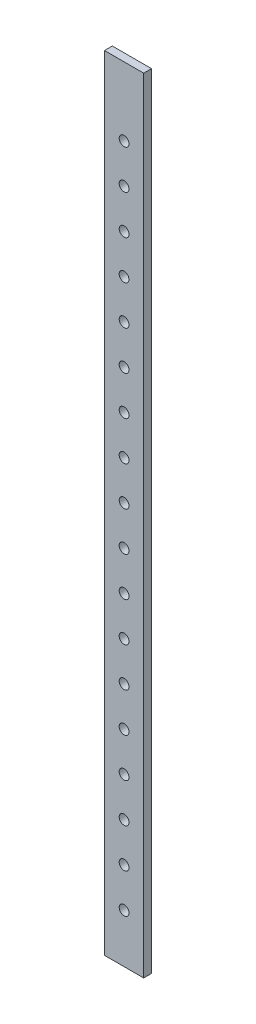
ISO-10303-21;
HEADER;
FILE_DESCRIPTION(('STEP AP214'),'2;1');
FILE_NAME('part.step','',(''),(''),'','','');
FILE_SCHEMA(('AUTOMOTIVE_DESIGN { 1 0 10303 214 1 1 1 1 }'));
ENDSEC;
DATA;
#1=APPLICATION_CONTEXT('core data for automotive mechanical design processes');
#2=APPLICATION_PROTOCOL_DEFINITION('international standard','automotive_design',2000,#1);
#3=PRODUCT_CONTEXT('',#1,'mechanical');
#4=PRODUCT('Part','Part','',(#3));
#5=PRODUCT_RELATED_PRODUCT_CATEGORY('part','',(#4));
#6=PRODUCT_DEFINITION_FORMATION('','',#4);
#7=PRODUCT_DEFINITION_CONTEXT('part definition',#1,'design');
#8=PRODUCT_DEFINITION('design','',#6,#7);
#9=PRODUCT_DEFINITION_SHAPE('','',#8);
#10=(LENGTH_UNIT() NAMED_UNIT(*) SI_UNIT(.MILLI.,.METRE.));
#11=(NAMED_UNIT(*) PLANE_ANGLE_UNIT() SI_UNIT($,.RADIAN.));
#12=(NAMED_UNIT(*) SI_UNIT($,.STERADIAN.) SOLID_ANGLE_UNIT());
#13=UNCERTAINTY_MEASURE_WITH_UNIT(LENGTH_MEASURE(1.E-05),#10,'distance_accuracy_value','');
#14=(GEOMETRIC_REPRESENTATION_CONTEXT(3) GLOBAL_UNCERTAINTY_ASSIGNED_CONTEXT((#13)) GLOBAL_UNIT_ASSIGNED_CONTEXT((#10,
#11,#12)) REPRESENTATION_CONTEXT('',''));
#15=CARTESIAN_POINT('',(0.,0.,0.));
#16=DIRECTION('',(0.,0.,1.));
#17=DIRECTION('',(1.,0.,0.));
#18=AXIS2_PLACEMENT_3D('',#15,#16,#17);
#19=CARTESIAN_POINT('',(10.,400.,-2.));
#20=DIRECTION('',(-1.,0.,0.));
#21=DIRECTION('',(0.,0.,1.));
#22=AXIS2_PLACEMENT_3D('',#19,#20,#21);
#23=PLANE('',#22);
#24=DIRECTION('',(0.,0.,-1.));
#25=VECTOR('',#24,1.);
#26=CARTESIAN_POINT('',(10.,0.,-2.));
#27=LINE('',#26,#25);
#28=CARTESIAN_POINT('',(10.,0.,2.));
#29=VERTEX_POINT('',#28);
#30=CARTESIAN_POINT('',(10.,0.,-2.));
#31=VERTEX_POINT('',#30);
#32=EDGE_CURVE('E98',#29,#31,#27,.T.);
#33=ORIENTED_EDGE('',*,*,#32,.T.);
#34=DIRECTION('',(0.,-1.,0.));
#35=VECTOR('',#34,1.);
#36=CARTESIAN_POINT('',(10.,400.,-2.));
#37=LINE('',#36,#35);
#38=CARTESIAN_POINT('',(10.,400.,-2.));
#39=VERTEX_POINT('',#38);
#40=EDGE_CURVE('E11',#39,#31,#37,.T.);
#41=ORIENTED_EDGE('',*,*,#40,.F.);
#42=DIRECTION('',(0.,0.,-1.));
#43=VECTOR('',#42,1.);
#44=CARTESIAN_POINT('',(10.,400.,-2.));
#45=LINE('',#44,#43);
#46=CARTESIAN_POINT('',(10.,400.,2.));
#47=VERTEX_POINT('',#46);
#48=EDGE_CURVE('E86',#47,#39,#45,.T.);
#49=ORIENTED_EDGE('',*,*,#48,.F.);
#50=DIRECTION('',(0.,-1.,0.));
#51=VECTOR('',#50,1.);
#52=CARTESIAN_POINT('',(10.,400.,2.));
#53=LINE('',#52,#51);
#54=EDGE_CURVE('E94',#47,#29,#53,.T.);
#55=ORIENTED_EDGE('',*,*,#54,.T.);
#56=EDGE_LOOP('',(#33,#41,#49,#55));
#57=FACE_BOUND('',#56,.T.);
#58=ADVANCED_FACE('F35',(#57),#23,.F.);
#59=CARTESIAN_POINT('',(-10.,400.,-2.));
#60=DIRECTION('',(0.,0.,1.));
#61=DIRECTION('',(1.,0.,0.));
#62=AXIS2_PLACEMENT_3D('',#59,#60,#61);
#63=PLANE('',#62);
#64=CARTESIAN_POINT('',(0.,25.,-2.));
#65=DIRECTION('',(0.,0.,1.));
#66=DIRECTION('',(1.,0.,0.));
#67=AXIS2_PLACEMENT_3D('',#64,#65,#66);
#68=CIRCLE('',#67,2.5);
#69=CARTESIAN_POINT('',(2.5,25.,-2.));
#70=VERTEX_POINT('',#69);
#71=EDGE_CURVE('E101',#70,#70,#68,.T.);
#72=ORIENTED_EDGE('',*,*,#71,.T.);
#73=EDGE_LOOP('',(#72));
#74=FACE_BOUND('',#73,.T.);
#75=CARTESIAN_POINT('',(0.,45.,-2.));
#76=DIRECTION('',(0.,0.,1.));
#77=DIRECTION('',(1.,0.,0.));
#78=AXIS2_PLACEMENT_3D('',#75,#76,#77);
#79=CIRCLE('',#78,2.5);
#80=CARTESIAN_POINT('',(2.49999999999993,45.,-2.));
#81=VERTEX_POINT('',#80);
#82=EDGE_CURVE('E211',#81,#81,#79,.T.);
#83=ORIENTED_EDGE('',*,*,#82,.T.);
#84=EDGE_LOOP('',(#83));
#85=FACE_BOUND('',#84,.T.);
#86=CARTESIAN_POINT('',(-1.39659253553725E-13,65.,-2.));
#87=DIRECTION('',(0.,0.,1.));
#88=DIRECTION('',(1.,0.,0.));
#89=AXIS2_PLACEMENT_3D('',#86,#87,#88);
#90=CIRCLE('',#89,2.5);
#91=CARTESIAN_POINT('',(2.49999999999986,65.,-2.));
#92=VERTEX_POINT('',#91);
#93=EDGE_CURVE('E205',#92,#92,#90,.T.);
#94=ORIENTED_EDGE('',*,*,#93,.T.);
#95=EDGE_LOOP('',(#94));
#96=FACE_BOUND('',#95,.T.);
#97=CARTESIAN_POINT('',(-2.09488880330588E-13,85.,-2.));
#98=DIRECTION('',(0.,0.,1.));
#99=DIRECTION('',(1.,0.,0.));
#100=AXIS2_PLACEMENT_3D('',#97,#98,#99);
#101=CIRCLE('',#100,2.5);
#102=CARTESIAN_POINT('',(2.49999999999979,85.,-2.));
#103=VERTEX_POINT('',#102);
#104=EDGE_CURVE('E199',#103,#103,#101,.T.);
#105=ORIENTED_EDGE('',*,*,#104,.T.);
#106=EDGE_LOOP('',(#105));
#107=FACE_BOUND('',#106,.T.);
#108=CARTESIAN_POINT('',(-2.79318507107451E-13,105.,-2.));
#109=DIRECTION('',(0.,0.,1.));
#110=DIRECTION('',(1.,0.,0.));
#111=AXIS2_PLACEMENT_3D('',#108,#109,#110);
#112=CIRCLE('',#111,2.5);
#113=CARTESIAN_POINT('',(2.49999999999972,105.,-2.));
#114=VERTEX_POINT('',#113);
#115=EDGE_CURVE('E193',#114,#114,#112,.T.);
#116=ORIENTED_EDGE('',*,*,#115,.T.);
#117=EDGE_LOOP('',(#116));
#118=FACE_BOUND('',#117,.T.);
#119=CARTESIAN_POINT('',(-3.49148133884313E-13,125.,-2.));
#120=DIRECTION('',(0.,0.,1.));
#121=DIRECTION('',(1.,0.,0.));
#122=AXIS2_PLACEMENT_3D('',#119,#120,#121);
#123=CIRCLE('',#122,2.5);
#124=CARTESIAN_POINT('',(2.49999999999965,125.,-2.));
#125=VERTEX_POINT('',#124);
#126=EDGE_CURVE('E187',#125,#125,#123,.T.);
#127=ORIENTED_EDGE('',*,*,#126,.T.);
#128=EDGE_LOOP('',(#127));
#129=FACE_BOUND('',#128,.T.);
#130=CARTESIAN_POINT('',(-4.18977760661176E-13,145.,-2.));
#131=DIRECTION('',(0.,0.,1.));
#132=DIRECTION('',(1.,0.,0.));
#133=AXIS2_PLACEMENT_3D('',#130,#131,#132);
#134=CIRCLE('',#133,2.5);
#135=CARTESIAN_POINT('',(2.49999999999958,145.,-2.));
#136=VERTEX_POINT('',#135);
#137=EDGE_CURVE('E181',#136,#136,#134,.T.);
#138=ORIENTED_EDGE('',*,*,#137,.T.);
#139=EDGE_LOOP('',(#138));
#140=FACE_BOUND('',#139,.T.);
#141=CARTESIAN_POINT('',(-4.88807387438039E-13,165.,-2.));
#142=DIRECTION('',(0.,0.,1.));
#143=DIRECTION('',(1.,0.,0.));
#144=AXIS2_PLACEMENT_3D('',#141,#142,#143);
#145=CIRCLE('',#144,2.5);
#146=CARTESIAN_POINT('',(2.49999999999951,165.,-2.));
#147=VERTEX_POINT('',#146);
#148=EDGE_CURVE('E175',#147,#147,#145,.T.);
#149=ORIENTED_EDGE('',*,*,#148,.T.);
#150=EDGE_LOOP('',(#149));
#151=FACE_BOUND('',#150,.T.);
#152=CARTESIAN_POINT('',(-5.58637014214901E-13,185.,-2.));
#153=DIRECTION('',(0.,0.,1.));
#154=DIRECTION('',(1.,0.,0.));
#155=AXIS2_PLACEMENT_3D('',#152,#153,#154);
#156=CIRCLE('',#155,2.5);
#157=CARTESIAN_POINT('',(2.49999999999944,185.,-2.));
#158=VERTEX_POINT('',#157);
#159=EDGE_CURVE('E169',#158,#158,#156,.T.);
#160=ORIENTED_EDGE('',*,*,#159,.T.);
#161=EDGE_LOOP('',(#160));
#162=FACE_BOUND('',#161,.T.);
#163=CARTESIAN_POINT('',(-6.28466640991764E-13,205.,-2.));
#164=DIRECTION('',(0.,0.,1.));
#165=DIRECTION('',(1.,0.,0.));
#166=AXIS2_PLACEMENT_3D('',#163,#164,#165);
#167=CIRCLE('',#166,2.5);
#168=CARTESIAN_POINT('',(2.49999999999937,205.,-2.));
#169=VERTEX_POINT('',#168);
#170=EDGE_CURVE('E163',#169,#169,#167,.T.);
#171=ORIENTED_EDGE('',*,*,#170,.T.);
#172=EDGE_LOOP('',(#171));
#173=FACE_BOUND('',#172,.T.);
#174=CARTESIAN_POINT('',(-6.98296267768627E-13,225.,-2.));
#175=DIRECTION('',(0.,0.,1.));
#176=DIRECTION('',(1.,0.,0.));
#177=AXIS2_PLACEMENT_3D('',#174,#175,#176);
#178=CIRCLE('',#177,2.5);
#179=CARTESIAN_POINT('',(2.4999999999993,225.,-2.));
#180=VERTEX_POINT('',#179);
#181=EDGE_CURVE('E157',#180,#180,#178,.T.);
#182=ORIENTED_EDGE('',*,*,#181,.T.);
#183=EDGE_LOOP('',(#182));
#184=FACE_BOUND('',#183,.T.);
#185=CARTESIAN_POINT('',(-7.68125894545489E-13,245.,-2.));
#186=DIRECTION('',(0.,0.,1.));
#187=DIRECTION('',(1.,0.,0.));
#188=AXIS2_PLACEMENT_3D('',#185,#186,#187);
#189=CIRCLE('',#188,2.5);
#190=CARTESIAN_POINT('',(2.49999999999923,245.,-2.));
#191=VERTEX_POINT('',#190);
#192=EDGE_CURVE('E151',#191,#191,#189,.T.);
#193=ORIENTED_EDGE('',*,*,#192,.T.);
#194=EDGE_LOOP('',(#193));
#195=FACE_BOUND('',#194,.T.);
#196=CARTESIAN_POINT('',(-8.37955521322352E-13,265.,-2.));
#197=DIRECTION('',(0.,0.,1.));
#198=DIRECTION('',(1.,0.,0.));
#199=AXIS2_PLACEMENT_3D('',#196,#197,#198);
#200=CIRCLE('',#199,2.5);
#201=CARTESIAN_POINT('',(2.49999999999916,265.,-2.));
#202=VERTEX_POINT('',#201);
#203=EDGE_CURVE('E145',#202,#202,#200,.T.);
#204=ORIENTED_EDGE('',*,*,#203,.T.);
#205=EDGE_LOOP('',(#204));
#206=FACE_BOUND('',#205,.T.);
#207=CARTESIAN_POINT('',(-9.07785148099215E-13,285.,-2.));
#208=DIRECTION('',(0.,0.,1.));
#209=DIRECTION('',(1.,0.,0.));
#210=AXIS2_PLACEMENT_3D('',#207,#208,#209);
#211=CIRCLE('',#210,2.5);
#212=CARTESIAN_POINT('',(2.49999999999909,285.,-2.));
#213=VERTEX_POINT('',#212);
#214=EDGE_CURVE('E139',#213,#213,#211,.T.);
#215=ORIENTED_EDGE('',*,*,#214,.T.);
#216=EDGE_LOOP('',(#215));
#217=FACE_BOUND('',#216,.T.);
#218=CARTESIAN_POINT('',(-9.77614774876077E-13,305.,-2.));
#219=DIRECTION('',(0.,0.,1.));
#220=DIRECTION('',(1.,0.,0.));
#221=AXIS2_PLACEMENT_3D('',#218,#219,#220);
#222=CIRCLE('',#221,2.5);
#223=CARTESIAN_POINT('',(2.49999999999902,305.,-2.));
#224=VERTEX_POINT('',#223);
#225=EDGE_CURVE('E133',#224,#224,#222,.T.);
#226=ORIENTED_EDGE('',*,*,#225,.T.);
#227=EDGE_LOOP('',(#226));
#228=FACE_BOUND('',#227,.T.);
#229=CARTESIAN_POINT('',(-1.04744440165294E-12,325.,-2.));
#230=DIRECTION('',(0.,0.,1.));
#231=DIRECTION('',(1.,0.,0.));
#232=AXIS2_PLACEMENT_3D('',#229,#230,#231);
#233=CIRCLE('',#232,2.5);
#234=CARTESIAN_POINT('',(2.49999999999895,325.,-2.));
#235=VERTEX_POINT('',#234);
#236=EDGE_CURVE('E127',#235,#235,#233,.T.);
#237=ORIENTED_EDGE('',*,*,#236,.T.);
#238=EDGE_LOOP('',(#237));
#239=FACE_BOUND('',#238,.T.);
#240=CARTESIAN_POINT('',(-1.1172740284298E-12,345.,-2.));
#241=DIRECTION('',(0.,0.,1.));
#242=DIRECTION('',(1.,0.,0.));
#243=AXIS2_PLACEMENT_3D('',#240,#241,#242);
#244=CIRCLE('',#243,2.5);
#245=CARTESIAN_POINT('',(2.49999999999888,345.,-2.));
#246=VERTEX_POINT('',#245);
#247=EDGE_CURVE('E121',#246,#246,#244,.T.);
#248=ORIENTED_EDGE('',*,*,#247,.T.);
#249=EDGE_LOOP('',(#248));
#250=FACE_BOUND('',#249,.T.);
#251=CARTESIAN_POINT('',(-1.18710365520667E-12,365.,-2.));
#252=DIRECTION('',(0.,0.,1.));
#253=DIRECTION('',(1.,0.,0.));
#254=AXIS2_PLACEMENT_3D('',#251,#252,#253);
#255=CIRCLE('',#254,2.5);
#256=CARTESIAN_POINT('',(2.49999999999881,365.,-2.));
#257=VERTEX_POINT('',#256);
#258=EDGE_CURVE('E115',#257,#257,#255,.T.);
#259=ORIENTED_EDGE('',*,*,#258,.T.);
#260=EDGE_LOOP('',(#259));
#261=FACE_BOUND('',#260,.T.);
#262=DIRECTION('',(-1.,0.,0.));
#263=VECTOR('',#262,1.);
#264=CARTESIAN_POINT('',(-10.,0.,-2.));
#265=LINE('',#264,#263);
#266=CARTESIAN_POINT('',(-10.,0.,-2.));
#267=VERTEX_POINT('',#266);
#268=EDGE_CURVE('E90',#31,#267,#265,.T.);
#269=ORIENTED_EDGE('',*,*,#268,.T.);
#270=DIRECTION('',(0.,-1.,0.));
#271=VECTOR('',#270,1.);
#272=CARTESIAN_POINT('',(-10.,400.,-2.));
#273=LINE('',#272,#271);
#274=CARTESIAN_POINT('',(-10.,400.,-2.));
#275=VERTEX_POINT('',#274);
#276=EDGE_CURVE('E43',#275,#267,#273,.T.);
#277=ORIENTED_EDGE('',*,*,#276,.F.);
#278=DIRECTION('',(-1.,0.,0.));
#279=VECTOR('',#278,1.);
#280=CARTESIAN_POINT('',(-10.,400.,-2.));
#281=LINE('',#280,#279);
#282=EDGE_CURVE('E81',#39,#275,#281,.T.);
#283=ORIENTED_EDGE('',*,*,#282,.F.);
#284=ORIENTED_EDGE('',*,*,#40,.T.);
#285=EDGE_LOOP('',(#269,#277,#283,#284));
#286=FACE_BOUND('',#285,.T.);
#287=ADVANCED_FACE('F89',(#74,#85,#96,#107,#118,#129,#140,#151,#162,#173,#184,#195,#206,#217,
#228,#239,#250,#261,#286),#63,.F.);
#288=CARTESIAN_POINT('',(-10.,400.,-2.));
#289=DIRECTION('',(1.,0.,0.));
#290=DIRECTION('',(0.,0.,-1.));
#291=AXIS2_PLACEMENT_3D('',#288,#289,#290);
#292=PLANE('',#291);
#293=DIRECTION('',(0.,0.,1.));
#294=VECTOR('',#293,1.);
#295=CARTESIAN_POINT('',(-10.,0.,-2.));
#296=LINE('',#295,#294);
#297=CARTESIAN_POINT('',(-10.,0.,2.));
#298=VERTEX_POINT('',#297);
#299=EDGE_CURVE('E68',#267,#298,#296,.T.);
#300=ORIENTED_EDGE('',*,*,#299,.T.);
#301=DIRECTION('',(0.,-1.,0.));
#302=VECTOR('',#301,1.);
#303=CARTESIAN_POINT('',(-10.,400.,2.));
#304=LINE('',#303,#302);
#305=CARTESIAN_POINT('',(-10.,400.,2.));
#306=VERTEX_POINT('',#305);
#307=EDGE_CURVE('E91',#306,#298,#304,.T.);
#308=ORIENTED_EDGE('',*,*,#307,.F.);
#309=DIRECTION('',(0.,0.,1.));
#310=VECTOR('',#309,1.);
#311=CARTESIAN_POINT('',(-10.,400.,-2.));
#312=LINE('',#311,#310);
#313=EDGE_CURVE('E84',#275,#306,#312,.T.);
#314=ORIENTED_EDGE('',*,*,#313,.F.);
#315=ORIENTED_EDGE('',*,*,#276,.T.);
#316=EDGE_LOOP('',(#300,#308,#314,#315));
#317=FACE_BOUND('',#316,.T.);
#318=ADVANCED_FACE('F92',(#317),#292,.F.);
#319=CARTESIAN_POINT('',(-10.,400.,2.));
#320=DIRECTION('',(0.,0.,-1.));
#321=DIRECTION('',(-1.,0.,0.));
#322=AXIS2_PLACEMENT_3D('',#319,#320,#321);
#323=PLANE('',#322);
#324=CARTESIAN_POINT('',(0.,25.,2.));
#325=DIRECTION('',(0.,0.,1.));
#326=DIRECTION('',(1.,0.,0.));
#327=AXIS2_PLACEMENT_3D('',#324,#325,#326);
#328=CIRCLE('',#327,2.5);
#329=CARTESIAN_POINT('',(2.5,25.,2.));
#330=VERTEX_POINT('',#329);
#331=EDGE_CURVE('E214',#330,#330,#328,.T.);
#332=ORIENTED_EDGE('',*,*,#331,.F.);
#333=EDGE_LOOP('',(#332));
#334=FACE_BOUND('',#333,.T.);
#335=CARTESIAN_POINT('',(0.,45.,2.));
#336=DIRECTION('',(0.,0.,1.));
#337=DIRECTION('',(1.,0.,0.));
#338=AXIS2_PLACEMENT_3D('',#335,#336,#337);
#339=CIRCLE('',#338,2.5);
#340=CARTESIAN_POINT('',(2.49999999999993,45.,2.));
#341=VERTEX_POINT('',#340);
#342=EDGE_CURVE('E208',#341,#341,#339,.T.);
#343=ORIENTED_EDGE('',*,*,#342,.F.);
#344=EDGE_LOOP('',(#343));
#345=FACE_BOUND('',#344,.T.);
#346=CARTESIAN_POINT('',(-1.39659253553725E-13,65.,2.));
#347=DIRECTION('',(0.,0.,1.));
#348=DIRECTION('',(1.,0.,0.));
#349=AXIS2_PLACEMENT_3D('',#346,#347,#348);
#350=CIRCLE('',#349,2.5);
#351=CARTESIAN_POINT('',(2.49999999999986,65.,2.));
#352=VERTEX_POINT('',#351);
#353=EDGE_CURVE('E202',#352,#352,#350,.T.);
#354=ORIENTED_EDGE('',*,*,#353,.F.);
#355=EDGE_LOOP('',(#354));
#356=FACE_BOUND('',#355,.T.);
#357=CARTESIAN_POINT('',(-2.09488880330588E-13,85.,2.));
#358=DIRECTION('',(0.,0.,1.));
#359=DIRECTION('',(1.,0.,0.));
#360=AXIS2_PLACEMENT_3D('',#357,#358,#359);
#361=CIRCLE('',#360,2.5);
#362=CARTESIAN_POINT('',(2.49999999999979,85.,2.));
#363=VERTEX_POINT('',#362);
#364=EDGE_CURVE('E196',#363,#363,#361,.T.);
#365=ORIENTED_EDGE('',*,*,#364,.F.);
#366=EDGE_LOOP('',(#365));
#367=FACE_BOUND('',#366,.T.);
#368=CARTESIAN_POINT('',(-2.79318507107451E-13,105.,2.));
#369=DIRECTION('',(0.,0.,1.));
#370=DIRECTION('',(1.,0.,0.));
#371=AXIS2_PLACEMENT_3D('',#368,#369,#370);
#372=CIRCLE('',#371,2.5);
#373=CARTESIAN_POINT('',(2.49999999999972,105.,2.));
#374=VERTEX_POINT('',#373);
#375=EDGE_CURVE('E190',#374,#374,#372,.T.);
#376=ORIENTED_EDGE('',*,*,#375,.F.);
#377=EDGE_LOOP('',(#376));
#378=FACE_BOUND('',#377,.T.);
#379=CARTESIAN_POINT('',(-3.49148133884313E-13,125.,2.));
#380=DIRECTION('',(0.,0.,1.));
#381=DIRECTION('',(1.,0.,0.));
#382=AXIS2_PLACEMENT_3D('',#379,#380,#381);
#383=CIRCLE('',#382,2.5);
#384=CARTESIAN_POINT('',(2.49999999999965,125.,2.));
#385=VERTEX_POINT('',#384);
#386=EDGE_CURVE('E184',#385,#385,#383,.T.);
#387=ORIENTED_EDGE('',*,*,#386,.F.);
#388=EDGE_LOOP('',(#387));
#389=FACE_BOUND('',#388,.T.);
#390=CARTESIAN_POINT('',(-4.18977760661176E-13,145.,2.));
#391=DIRECTION('',(0.,0.,1.));
#392=DIRECTION('',(1.,0.,0.));
#393=AXIS2_PLACEMENT_3D('',#390,#391,#392);
#394=CIRCLE('',#393,2.5);
#395=CARTESIAN_POINT('',(2.49999999999958,145.,2.));
#396=VERTEX_POINT('',#395);
#397=EDGE_CURVE('E178',#396,#396,#394,.T.);
#398=ORIENTED_EDGE('',*,*,#397,.F.);
#399=EDGE_LOOP('',(#398));
#400=FACE_BOUND('',#399,.T.);
#401=CARTESIAN_POINT('',(-4.88807387438039E-13,165.,2.));
#402=DIRECTION('',(0.,0.,1.));
#403=DIRECTION('',(1.,0.,0.));
#404=AXIS2_PLACEMENT_3D('',#401,#402,#403);
#405=CIRCLE('',#404,2.5);
#406=CARTESIAN_POINT('',(2.49999999999951,165.,2.));
#407=VERTEX_POINT('',#406);
#408=EDGE_CURVE('E172',#407,#407,#405,.T.);
#409=ORIENTED_EDGE('',*,*,#408,.F.);
#410=EDGE_LOOP('',(#409));
#411=FACE_BOUND('',#410,.T.);
#412=CARTESIAN_POINT('',(-5.58637014214901E-13,185.,2.));
#413=DIRECTION('',(0.,0.,1.));
#414=DIRECTION('',(1.,0.,0.));
#415=AXIS2_PLACEMENT_3D('',#412,#413,#414);
#416=CIRCLE('',#415,2.5);
#417=CARTESIAN_POINT('',(2.49999999999944,185.,2.));
#418=VERTEX_POINT('',#417);
#419=EDGE_CURVE('E166',#418,#418,#416,.T.);
#420=ORIENTED_EDGE('',*,*,#419,.F.);
#421=EDGE_LOOP('',(#420));
#422=FACE_BOUND('',#421,.T.);
#423=CARTESIAN_POINT('',(-6.28466640991764E-13,205.,2.));
#424=DIRECTION('',(0.,0.,1.));
#425=DIRECTION('',(1.,0.,0.));
#426=AXIS2_PLACEMENT_3D('',#423,#424,#425);
#427=CIRCLE('',#426,2.5);
#428=CARTESIAN_POINT('',(2.49999999999937,205.,2.));
#429=VERTEX_POINT('',#428);
#430=EDGE_CURVE('E160',#429,#429,#427,.T.);
#431=ORIENTED_EDGE('',*,*,#430,.F.);
#432=EDGE_LOOP('',(#431));
#433=FACE_BOUND('',#432,.T.);
#434=CARTESIAN_POINT('',(-6.98296267768627E-13,225.,2.));
#435=DIRECTION('',(0.,0.,1.));
#436=DIRECTION('',(1.,0.,0.));
#437=AXIS2_PLACEMENT_3D('',#434,#435,#436);
#438=CIRCLE('',#437,2.5);
#439=CARTESIAN_POINT('',(2.4999999999993,225.,2.));
#440=VERTEX_POINT('',#439);
#441=EDGE_CURVE('E154',#440,#440,#438,.T.);
#442=ORIENTED_EDGE('',*,*,#441,.F.);
#443=EDGE_LOOP('',(#442));
#444=FACE_BOUND('',#443,.T.);
#445=CARTESIAN_POINT('',(-7.68125894545489E-13,245.,2.));
#446=DIRECTION('',(0.,0.,1.));
#447=DIRECTION('',(1.,0.,0.));
#448=AXIS2_PLACEMENT_3D('',#445,#446,#447);
#449=CIRCLE('',#448,2.5);
#450=CARTESIAN_POINT('',(2.49999999999923,245.,2.));
#451=VERTEX_POINT('',#450);
#452=EDGE_CURVE('E148',#451,#451,#449,.T.);
#453=ORIENTED_EDGE('',*,*,#452,.F.);
#454=EDGE_LOOP('',(#453));
#455=FACE_BOUND('',#454,.T.);
#456=CARTESIAN_POINT('',(-8.37955521322352E-13,265.,2.));
#457=DIRECTION('',(0.,0.,1.));
#458=DIRECTION('',(1.,0.,0.));
#459=AXIS2_PLACEMENT_3D('',#456,#457,#458);
#460=CIRCLE('',#459,2.5);
#461=CARTESIAN_POINT('',(2.49999999999916,265.,2.));
#462=VERTEX_POINT('',#461);
#463=EDGE_CURVE('E142',#462,#462,#460,.T.);
#464=ORIENTED_EDGE('',*,*,#463,.F.);
#465=EDGE_LOOP('',(#464));
#466=FACE_BOUND('',#465,.T.);
#467=CARTESIAN_POINT('',(-9.07785148099215E-13,285.,2.));
#468=DIRECTION('',(0.,0.,1.));
#469=DIRECTION('',(1.,0.,0.));
#470=AXIS2_PLACEMENT_3D('',#467,#468,#469);
#471=CIRCLE('',#470,2.5);
#472=CARTESIAN_POINT('',(2.49999999999909,285.,2.));
#473=VERTEX_POINT('',#472);
#474=EDGE_CURVE('E136',#473,#473,#471,.T.);
#475=ORIENTED_EDGE('',*,*,#474,.F.);
#476=EDGE_LOOP('',(#475));
#477=FACE_BOUND('',#476,.T.);
#478=CARTESIAN_POINT('',(-9.77614774876077E-13,305.,2.));
#479=DIRECTION('',(0.,0.,1.));
#480=DIRECTION('',(1.,0.,0.));
#481=AXIS2_PLACEMENT_3D('',#478,#479,#480);
#482=CIRCLE('',#481,2.5);
#483=CARTESIAN_POINT('',(2.49999999999902,305.,2.));
#484=VERTEX_POINT('',#483);
#485=EDGE_CURVE('E130',#484,#484,#482,.T.);
#486=ORIENTED_EDGE('',*,*,#485,.F.);
#487=EDGE_LOOP('',(#486));
#488=FACE_BOUND('',#487,.T.);
#489=CARTESIAN_POINT('',(-1.04744440165294E-12,325.,2.));
#490=DIRECTION('',(0.,0.,1.));
#491=DIRECTION('',(1.,0.,0.));
#492=AXIS2_PLACEMENT_3D('',#489,#490,#491);
#493=CIRCLE('',#492,2.5);
#494=CARTESIAN_POINT('',(2.49999999999895,325.,2.));
#495=VERTEX_POINT('',#494);
#496=EDGE_CURVE('E124',#495,#495,#493,.T.);
#497=ORIENTED_EDGE('',*,*,#496,.F.);
#498=EDGE_LOOP('',(#497));
#499=FACE_BOUND('',#498,.T.);
#500=CARTESIAN_POINT('',(-1.1172740284298E-12,345.,2.));
#501=DIRECTION('',(0.,0.,1.));
#502=DIRECTION('',(1.,0.,0.));
#503=AXIS2_PLACEMENT_3D('',#500,#501,#502);
#504=CIRCLE('',#503,2.5);
#505=CARTESIAN_POINT('',(2.49999999999888,345.,2.));
#506=VERTEX_POINT('',#505);
#507=EDGE_CURVE('E118',#506,#506,#504,.T.);
#508=ORIENTED_EDGE('',*,*,#507,.F.);
#509=EDGE_LOOP('',(#508));
#510=FACE_BOUND('',#509,.T.);
#511=CARTESIAN_POINT('',(-1.18710365520667E-12,365.,2.));
#512=DIRECTION('',(0.,0.,1.));
#513=DIRECTION('',(1.,0.,0.));
#514=AXIS2_PLACEMENT_3D('',#511,#512,#513);
#515=CIRCLE('',#514,2.5);
#516=CARTESIAN_POINT('',(2.49999999999881,365.,2.));
#517=VERTEX_POINT('',#516);
#518=EDGE_CURVE('E112',#517,#517,#515,.T.);
#519=ORIENTED_EDGE('',*,*,#518,.F.);
#520=EDGE_LOOP('',(#519));
#521=FACE_BOUND('',#520,.T.);
#522=DIRECTION('',(1.,0.,0.));
#523=VECTOR('',#522,1.);
#524=CARTESIAN_POINT('',(-10.,0.,2.));
#525=LINE('',#524,#523);
#526=EDGE_CURVE('E74',#298,#29,#525,.T.);
#527=ORIENTED_EDGE('',*,*,#526,.T.);
#528=ORIENTED_EDGE('',*,*,#54,.F.);
#529=DIRECTION('',(1.,0.,0.));
#530=VECTOR('',#529,1.);
#531=CARTESIAN_POINT('',(-10.,400.,2.));
#532=LINE('',#531,#530);
#533=EDGE_CURVE('E51',#306,#47,#532,.T.);
#534=ORIENTED_EDGE('',*,*,#533,.F.);
#535=ORIENTED_EDGE('',*,*,#307,.T.);
#536=EDGE_LOOP('',(#527,#528,#534,#535));
#537=FACE_BOUND('',#536,.T.);
#538=ADVANCED_FACE('F106',(#334,#345,#356,#367,#378,#389,#400,#411,#422,#433,#444,#455,#466,
#477,#488,#499,#510,#521,#537),#323,.F.);
#539=CARTESIAN_POINT('',(0.,400.,0.));
#540=DIRECTION('',(0.,1.,0.));
#541=DIRECTION('',(0.,0.,1.));
#542=AXIS2_PLACEMENT_3D('',#539,#540,#541);
#543=PLANE('',#542);
#544=ORIENTED_EDGE('',*,*,#48,.T.);
#545=ORIENTED_EDGE('',*,*,#282,.T.);
#546=ORIENTED_EDGE('',*,*,#313,.T.);
#547=ORIENTED_EDGE('',*,*,#533,.T.);
#548=EDGE_LOOP('',(#544,#545,#546,#547));
#549=FACE_BOUND('',#548,.T.);
#550=ADVANCED_FACE('F82',(#549),#543,.T.);
#551=CARTESIAN_POINT('',(0.,0.,0.));
#552=DIRECTION('',(0.,1.,0.));
#553=DIRECTION('',(0.,0.,1.));
#554=AXIS2_PLACEMENT_3D('',#551,#552,#553);
#555=PLANE('',#554);
#556=ORIENTED_EDGE('',*,*,#32,.F.);
#557=ORIENTED_EDGE('',*,*,#526,.F.);
#558=ORIENTED_EDGE('',*,*,#299,.F.);
#559=ORIENTED_EDGE('',*,*,#268,.F.);
#560=EDGE_LOOP('',(#556,#557,#558,#559));
#561=FACE_BOUND('',#560,.T.);
#562=ADVANCED_FACE('F109',(#561),#555,.F.);
#563=CARTESIAN_POINT('',(-1.18710365520667E-12,365.,-2.));
#564=DIRECTION('',(0.,0.,1.));
#565=DIRECTION('',(1.,0.,0.));
#566=AXIS2_PLACEMENT_3D('',#563,#564,#565);
#567=CYLINDRICAL_SURFACE('',#566,2.5);
#568=ORIENTED_EDGE('',*,*,#258,.F.);
#569=EDGE_LOOP('',(#568));
#570=FACE_BOUND('',#569,.T.);
#571=ORIENTED_EDGE('',*,*,#518,.T.);
#572=EDGE_LOOP('',(#571));
#573=FACE_BOUND('',#572,.T.);
#574=ADVANCED_FACE('F266',(#570,#573),#567,.F.);
#575=CARTESIAN_POINT('',(-1.1172740284298E-12,345.,-2.));
#576=DIRECTION('',(0.,0.,1.));
#577=DIRECTION('',(1.,0.,0.));
#578=AXIS2_PLACEMENT_3D('',#575,#576,#577);
#579=CYLINDRICAL_SURFACE('',#578,2.5);
#580=ORIENTED_EDGE('',*,*,#247,.F.);
#581=EDGE_LOOP('',(#580));
#582=FACE_BOUND('',#581,.T.);
#583=ORIENTED_EDGE('',*,*,#507,.T.);
#584=EDGE_LOOP('',(#583));
#585=FACE_BOUND('',#584,.T.);
#586=ADVANCED_FACE('F268',(#582,#585),#579,.F.);
#587=CARTESIAN_POINT('',(-1.04744440165294E-12,325.,-2.));
#588=DIRECTION('',(0.,0.,1.));
#589=DIRECTION('',(1.,0.,0.));
#590=AXIS2_PLACEMENT_3D('',#587,#588,#589);
#591=CYLINDRICAL_SURFACE('',#590,2.5);
#592=ORIENTED_EDGE('',*,*,#236,.F.);
#593=EDGE_LOOP('',(#592));
#594=FACE_BOUND('',#593,.T.);
#595=ORIENTED_EDGE('',*,*,#496,.T.);
#596=EDGE_LOOP('',(#595));
#597=FACE_BOUND('',#596,.T.);
#598=ADVANCED_FACE('F275',(#594,#597),#591,.F.);
#599=CARTESIAN_POINT('',(-9.77614774876077E-13,305.,-2.));
#600=DIRECTION('',(0.,0.,1.));
#601=DIRECTION('',(1.,0.,0.));
#602=AXIS2_PLACEMENT_3D('',#599,#600,#601);
#603=CYLINDRICAL_SURFACE('',#602,2.5);
#604=ORIENTED_EDGE('',*,*,#225,.F.);
#605=EDGE_LOOP('',(#604));
#606=FACE_BOUND('',#605,.T.);
#607=ORIENTED_EDGE('',*,*,#485,.T.);
#608=EDGE_LOOP('',(#607));
#609=FACE_BOUND('',#608,.T.);
#610=ADVANCED_FACE('F321',(#606,#609),#603,.F.);
#611=CARTESIAN_POINT('',(-9.07785148099215E-13,285.,-2.));
#612=DIRECTION('',(0.,0.,1.));
#613=DIRECTION('',(1.,0.,0.));
#614=AXIS2_PLACEMENT_3D('',#611,#612,#613);
#615=CYLINDRICAL_SURFACE('',#614,2.5);
#616=ORIENTED_EDGE('',*,*,#214,.F.);
#617=EDGE_LOOP('',(#616));
#618=FACE_BOUND('',#617,.T.);
#619=ORIENTED_EDGE('',*,*,#474,.T.);
#620=EDGE_LOOP('',(#619));
#621=FACE_BOUND('',#620,.T.);
#622=ADVANCED_FACE('F330',(#618,#621),#615,.F.);
#623=CARTESIAN_POINT('',(-8.37955521322352E-13,265.,-2.));
#624=DIRECTION('',(0.,0.,1.));
#625=DIRECTION('',(1.,0.,0.));
#626=AXIS2_PLACEMENT_3D('',#623,#624,#625);
#627=CYLINDRICAL_SURFACE('',#626,2.5);
#628=ORIENTED_EDGE('',*,*,#203,.F.);
#629=EDGE_LOOP('',(#628));
#630=FACE_BOUND('',#629,.T.);
#631=ORIENTED_EDGE('',*,*,#463,.T.);
#632=EDGE_LOOP('',(#631));
#633=FACE_BOUND('',#632,.T.);
#634=ADVANCED_FACE('F339',(#630,#633),#627,.F.);
#635=CARTESIAN_POINT('',(-7.68125894545489E-13,245.,-2.));
#636=DIRECTION('',(0.,0.,1.));
#637=DIRECTION('',(1.,0.,0.));
#638=AXIS2_PLACEMENT_3D('',#635,#636,#637);
#639=CYLINDRICAL_SURFACE('',#638,2.5);
#640=ORIENTED_EDGE('',*,*,#192,.F.);
#641=EDGE_LOOP('',(#640));
#642=FACE_BOUND('',#641,.T.);
#643=ORIENTED_EDGE('',*,*,#452,.T.);
#644=EDGE_LOOP('',(#643));
#645=FACE_BOUND('',#644,.T.);
#646=ADVANCED_FACE('F348',(#642,#645),#639,.F.);
#647=CARTESIAN_POINT('',(-6.98296267768627E-13,225.,-2.));
#648=DIRECTION('',(0.,0.,1.));
#649=DIRECTION('',(1.,0.,0.));
#650=AXIS2_PLACEMENT_3D('',#647,#648,#649);
#651=CYLINDRICAL_SURFACE('',#650,2.5);
#652=ORIENTED_EDGE('',*,*,#181,.F.);
#653=EDGE_LOOP('',(#652));
#654=FACE_BOUND('',#653,.T.);
#655=ORIENTED_EDGE('',*,*,#441,.T.);
#656=EDGE_LOOP('',(#655));
#657=FACE_BOUND('',#656,.T.);
#658=ADVANCED_FACE('F357',(#654,#657),#651,.F.);
#659=CARTESIAN_POINT('',(-6.28466640991764E-13,205.,-2.));
#660=DIRECTION('',(0.,0.,1.));
#661=DIRECTION('',(1.,0.,0.));
#662=AXIS2_PLACEMENT_3D('',#659,#660,#661);
#663=CYLINDRICAL_SURFACE('',#662,2.5);
#664=ORIENTED_EDGE('',*,*,#170,.F.);
#665=EDGE_LOOP('',(#664));
#666=FACE_BOUND('',#665,.T.);
#667=ORIENTED_EDGE('',*,*,#430,.T.);
#668=EDGE_LOOP('',(#667));
#669=FACE_BOUND('',#668,.T.);
#670=ADVANCED_FACE('F366',(#666,#669),#663,.F.);
#671=CARTESIAN_POINT('',(-5.58637014214901E-13,185.,-2.));
#672=DIRECTION('',(0.,0.,1.));
#673=DIRECTION('',(1.,0.,0.));
#674=AXIS2_PLACEMENT_3D('',#671,#672,#673);
#675=CYLINDRICAL_SURFACE('',#674,2.5);
#676=ORIENTED_EDGE('',*,*,#159,.F.);
#677=EDGE_LOOP('',(#676));
#678=FACE_BOUND('',#677,.T.);
#679=ORIENTED_EDGE('',*,*,#419,.T.);
#680=EDGE_LOOP('',(#679));
#681=FACE_BOUND('',#680,.T.);
#682=ADVANCED_FACE('F375',(#678,#681),#675,.F.);
#683=CARTESIAN_POINT('',(-4.88807387438039E-13,165.,-2.));
#684=DIRECTION('',(0.,0.,1.));
#685=DIRECTION('',(1.,0.,0.));
#686=AXIS2_PLACEMENT_3D('',#683,#684,#685);
#687=CYLINDRICAL_SURFACE('',#686,2.5);
#688=ORIENTED_EDGE('',*,*,#148,.F.);
#689=EDGE_LOOP('',(#688));
#690=FACE_BOUND('',#689,.T.);
#691=ORIENTED_EDGE('',*,*,#408,.T.);
#692=EDGE_LOOP('',(#691));
#693=FACE_BOUND('',#692,.T.);
#694=ADVANCED_FACE('F384',(#690,#693),#687,.F.);
#695=CARTESIAN_POINT('',(-4.18977760661176E-13,145.,-2.));
#696=DIRECTION('',(0.,0.,1.));
#697=DIRECTION('',(1.,0.,0.));
#698=AXIS2_PLACEMENT_3D('',#695,#696,#697);
#699=CYLINDRICAL_SURFACE('',#698,2.5);
#700=ORIENTED_EDGE('',*,*,#137,.F.);
#701=EDGE_LOOP('',(#700));
#702=FACE_BOUND('',#701,.T.);
#703=ORIENTED_EDGE('',*,*,#397,.T.);
#704=EDGE_LOOP('',(#703));
#705=FACE_BOUND('',#704,.T.);
#706=ADVANCED_FACE('F393',(#702,#705),#699,.F.);
#707=CARTESIAN_POINT('',(-3.49148133884313E-13,125.,-2.));
#708=DIRECTION('',(0.,0.,1.));
#709=DIRECTION('',(1.,0.,0.));
#710=AXIS2_PLACEMENT_3D('',#707,#708,#709);
#711=CYLINDRICAL_SURFACE('',#710,2.5);
#712=ORIENTED_EDGE('',*,*,#126,.F.);
#713=EDGE_LOOP('',(#712));
#714=FACE_BOUND('',#713,.T.);
#715=ORIENTED_EDGE('',*,*,#386,.T.);
#716=EDGE_LOOP('',(#715));
#717=FACE_BOUND('',#716,.T.);
#718=ADVANCED_FACE('F402',(#714,#717),#711,.F.);
#719=CARTESIAN_POINT('',(-2.79318507107451E-13,105.,-2.));
#720=DIRECTION('',(0.,0.,1.));
#721=DIRECTION('',(1.,0.,0.));
#722=AXIS2_PLACEMENT_3D('',#719,#720,#721);
#723=CYLINDRICAL_SURFACE('',#722,2.5);
#724=ORIENTED_EDGE('',*,*,#115,.F.);
#725=EDGE_LOOP('',(#724));
#726=FACE_BOUND('',#725,.T.);
#727=ORIENTED_EDGE('',*,*,#375,.T.);
#728=EDGE_LOOP('',(#727));
#729=FACE_BOUND('',#728,.T.);
#730=ADVANCED_FACE('F411',(#726,#729),#723,.F.);
#731=CARTESIAN_POINT('',(-2.09488880330588E-13,85.,-2.));
#732=DIRECTION('',(0.,0.,1.));
#733=DIRECTION('',(1.,0.,0.));
#734=AXIS2_PLACEMENT_3D('',#731,#732,#733);
#735=CYLINDRICAL_SURFACE('',#734,2.5);
#736=ORIENTED_EDGE('',*,*,#104,.F.);
#737=EDGE_LOOP('',(#736));
#738=FACE_BOUND('',#737,.T.);
#739=ORIENTED_EDGE('',*,*,#364,.T.);
#740=EDGE_LOOP('',(#739));
#741=FACE_BOUND('',#740,.T.);
#742=ADVANCED_FACE('F420',(#738,#741),#735,.F.);
#743=CARTESIAN_POINT('',(-1.39659253553725E-13,65.,-2.));
#744=DIRECTION('',(0.,0.,1.));
#745=DIRECTION('',(1.,0.,0.));
#746=AXIS2_PLACEMENT_3D('',#743,#744,#745);
#747=CYLINDRICAL_SURFACE('',#746,2.5);
#748=ORIENTED_EDGE('',*,*,#93,.F.);
#749=EDGE_LOOP('',(#748));
#750=FACE_BOUND('',#749,.T.);
#751=ORIENTED_EDGE('',*,*,#353,.T.);
#752=EDGE_LOOP('',(#751));
#753=FACE_BOUND('',#752,.T.);
#754=ADVANCED_FACE('F429',(#750,#753),#747,.F.);
#755=CARTESIAN_POINT('',(0.,45.,-2.));
#756=DIRECTION('',(0.,0.,1.));
#757=DIRECTION('',(1.,0.,0.));
#758=AXIS2_PLACEMENT_3D('',#755,#756,#757);
#759=CYLINDRICAL_SURFACE('',#758,2.5);
#760=ORIENTED_EDGE('',*,*,#82,.F.);
#761=EDGE_LOOP('',(#760));
#762=FACE_BOUND('',#761,.T.);
#763=ORIENTED_EDGE('',*,*,#342,.T.);
#764=EDGE_LOOP('',(#763));
#765=FACE_BOUND('',#764,.T.);
#766=ADVANCED_FACE('F225',(#762,#765),#759,.F.);
#767=CARTESIAN_POINT('',(0.,25.,-2.));
#768=DIRECTION('',(0.,0.,1.));
#769=DIRECTION('',(1.,0.,0.));
#770=AXIS2_PLACEMENT_3D('',#767,#768,#769);
#771=CYLINDRICAL_SURFACE('',#770,2.5);
#772=ORIENTED_EDGE('',*,*,#71,.F.);
#773=EDGE_LOOP('',(#772));
#774=FACE_BOUND('',#773,.T.);
#775=ORIENTED_EDGE('',*,*,#331,.T.);
#776=EDGE_LOOP('',(#775));
#777=FACE_BOUND('',#776,.T.);
#778=ADVANCED_FACE('F222',(#774,#777),#771,.F.);
#779=CLOSED_SHELL('',(#58,#287,#318,#538,#550,#562,#574,#586,#598,#610,#622,#634,#646,#658,#670,
#682,#694,#706,#718,#730,#742,#754,#766,#778));
#780=MANIFOLD_SOLID_BREP('B2',#779);
#781=ADVANCED_BREP_SHAPE_REPRESENTATION('',(#18,#780),#14);
#782=SHAPE_DEFINITION_REPRESENTATION(#9,#781);
ENDSEC;
END-ISO-10303-21;
